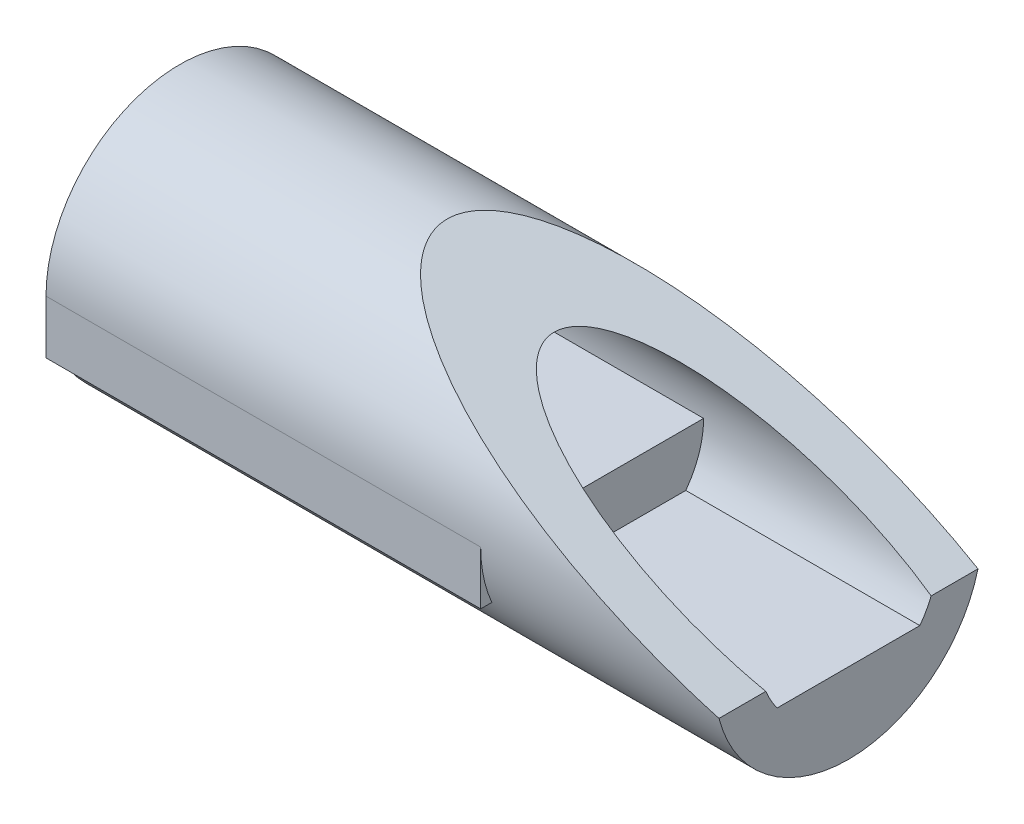
ISO-10303-21;
HEADER;
FILE_DESCRIPTION(('STEP AP214'),'2;1');
FILE_NAME('part.step','',(''),(''),'','','');
FILE_SCHEMA(('AUTOMOTIVE_DESIGN { 1 0 10303 214 1 1 1 1 }'));
ENDSEC;
DATA;
#1=APPLICATION_CONTEXT('core data for automotive mechanical design processes');
#2=APPLICATION_PROTOCOL_DEFINITION('international standard','automotive_design',2000,#1);
#3=PRODUCT_CONTEXT('',#1,'mechanical');
#4=PRODUCT('Part','Part','',(#3));
#5=PRODUCT_RELATED_PRODUCT_CATEGORY('part','',(#4));
#6=PRODUCT_DEFINITION_FORMATION('','',#4);
#7=PRODUCT_DEFINITION_CONTEXT('part definition',#1,'design');
#8=PRODUCT_DEFINITION('design','',#6,#7);
#9=PRODUCT_DEFINITION_SHAPE('','',#8);
#10=(LENGTH_UNIT() NAMED_UNIT(*) SI_UNIT(.MILLI.,.METRE.));
#11=(NAMED_UNIT(*) PLANE_ANGLE_UNIT() SI_UNIT($,.RADIAN.));
#12=(NAMED_UNIT(*) SI_UNIT($,.STERADIAN.) SOLID_ANGLE_UNIT());
#13=UNCERTAINTY_MEASURE_WITH_UNIT(LENGTH_MEASURE(1.E-05),#10,'distance_accuracy_value','');
#14=(GEOMETRIC_REPRESENTATION_CONTEXT(3) GLOBAL_UNCERTAINTY_ASSIGNED_CONTEXT((#13)) GLOBAL_UNIT_ASSIGNED_CONTEXT((#10,
#11,#12)) REPRESENTATION_CONTEXT('',''));
#15=CARTESIAN_POINT('',(0.,0.,0.));
#16=DIRECTION('',(0.,0.,1.));
#17=DIRECTION('',(1.,0.,0.));
#18=AXIS2_PLACEMENT_3D('',#15,#16,#17);
#19=CARTESIAN_POINT('',(-100.,0.,0.));
#20=DIRECTION('',(1.,0.,0.));
#21=DIRECTION('',(0.,0.,-1.));
#22=AXIS2_PLACEMENT_3D('',#19,#20,#21);
#23=CYLINDRICAL_SURFACE('',#22,13.3375847050911);
#24=CARTESIAN_POINT('',(-12.,0.,0.));
#25=DIRECTION('',(0.384615384615385,0.923076923076923,0.));
#26=DIRECTION('',(0.923076923076923,-0.384615384615385,0.));
#27=AXIS2_PLACEMENT_3D('',#24,#25,#26);
#28=ELLIPSE('',#27,34.6777202332369,13.3375847050911);
#29=CARTESIAN_POINT('',(0.,-5.,12.3649167310371));
#30=VERTEX_POINT('',#29);
#31=CARTESIAN_POINT('',(0.,-5.,-12.3649167310371));
#32=VERTEX_POINT('',#31);
#33=EDGE_CURVE('E185',#30,#32,#28,.F.);
#34=ORIENTED_EDGE('',*,*,#33,.F.);
#35=CARTESIAN_POINT('',(0.,0.,0.));
#36=DIRECTION('',(1.,0.,0.));
#37=DIRECTION('',(0.,0.,-1.));
#38=AXIS2_PLACEMENT_3D('',#35,#36,#37);
#39=CIRCLE('',#38,13.3375847050911);
#40=CARTESIAN_POINT('',(0.,-8.,10.6719804050364));
#41=VERTEX_POINT('',#40);
#42=EDGE_CURVE('E194',#30,#41,#39,.T.);
#43=ORIENTED_EDGE('',*,*,#42,.T.);
#44=DIRECTION('',(1.,0.,0.));
#45=VECTOR('',#44,1.);
#46=CARTESIAN_POINT('',(-100.,-8.,10.6719804050364));
#47=LINE('',#46,#45);
#48=CARTESIAN_POINT('',(-35.,-8.,10.6719804050364));
#49=VERTEX_POINT('',#48);
#50=EDGE_CURVE('E207',#49,#41,#47,.T.);
#51=ORIENTED_EDGE('',*,*,#50,.F.);
#52=CARTESIAN_POINT('',(-35.,0.,0.));
#53=DIRECTION('',(-1.,0.,0.));
#54=DIRECTION('',(0.,0.,1.));
#55=AXIS2_PLACEMENT_3D('',#52,#53,#54);
#56=CIRCLE('',#55,13.3375847050911);
#57=CARTESIAN_POINT('',(-35.,0.,13.3375847050911));
#58=VERTEX_POINT('',#57);
#59=EDGE_CURVE('E195',#58,#49,#56,.F.);
#60=ORIENTED_EDGE('',*,*,#59,.F.);
#61=DIRECTION('',(1.,0.,0.));
#62=VECTOR('',#61,1.);
#63=CARTESIAN_POINT('',(-100.,0.,13.3375847050911));
#64=LINE('',#63,#62);
#65=CARTESIAN_POINT('',(-100.,0.,13.3375847050911));
#66=VERTEX_POINT('',#65);
#67=EDGE_CURVE('E258',#58,#66,#64,.F.);
#68=ORIENTED_EDGE('',*,*,#67,.T.);
#69=CARTESIAN_POINT('',(-100.,0.,0.));
#70=DIRECTION('',(1.,0.,0.));
#71=DIRECTION('',(0.,0.,-1.));
#72=AXIS2_PLACEMENT_3D('',#69,#70,#71);
#73=CIRCLE('',#72,13.3375847050911);
#74=CARTESIAN_POINT('',(-100.,0.,-13.3375847050911));
#75=VERTEX_POINT('',#74);
#76=EDGE_CURVE('E206',#75,#66,#73,.T.);
#77=ORIENTED_EDGE('',*,*,#76,.F.);
#78=DIRECTION('',(1.,0.,0.));
#79=VECTOR('',#78,1.);
#80=CARTESIAN_POINT('',(-100.,0.,-13.3375847050911));
#81=LINE('',#80,#79);
#82=CARTESIAN_POINT('',(-35.,0.,-13.3375847050911));
#83=VERTEX_POINT('',#82);
#84=EDGE_CURVE('E255',#75,#83,#81,.T.);
#85=ORIENTED_EDGE('',*,*,#84,.T.);
#86=CARTESIAN_POINT('',(-35.,-8.,-10.6719804050364));
#87=VERTEX_POINT('',#86);
#88=EDGE_CURVE('E199',#87,#83,#56,.F.);
#89=ORIENTED_EDGE('',*,*,#88,.F.);
#90=DIRECTION('',(1.,0.,0.));
#91=VECTOR('',#90,1.);
#92=CARTESIAN_POINT('',(-100.,-8.,-10.6719804050364));
#93=LINE('',#92,#91);
#94=CARTESIAN_POINT('',(0.,-8.,-10.6719804050364));
#95=VERTEX_POINT('',#94);
#96=EDGE_CURVE('E211',#87,#95,#93,.T.);
#97=ORIENTED_EDGE('',*,*,#96,.T.);
#98=EDGE_CURVE('E197',#95,#32,#39,.T.);
#99=ORIENTED_EDGE('',*,*,#98,.T.);
#100=EDGE_LOOP('',(#34,#43,#51,#60,#68,#77,#85,#89,#97,#99));
#101=FACE_BOUND('',#100,.T.);
#102=ADVANCED_FACE('F95',(#101),#23,.F.);
#103=CARTESIAN_POINT('',(-100.,0.,0.));
#104=DIRECTION('',(1.,0.,0.));
#105=DIRECTION('',(0.,0.,-1.));
#106=AXIS2_PLACEMENT_3D('',#103,#104,#105);
#107=CYLINDRICAL_SURFACE('',#106,20.);
#108=DIRECTION('',(-1.,0.,0.));
#109=VECTOR('',#108,1.);
#110=CARTESIAN_POINT('',(0.,0.,20.));
#111=LINE('',#110,#109);
#112=CARTESIAN_POINT('',(-35.,0.,20.));
#113=VERTEX_POINT('',#112);
#114=CARTESIAN_POINT('',(-100.,0.,20.));
#115=VERTEX_POINT('',#114);
#116=EDGE_CURVE('E226',#113,#115,#111,.T.);
#117=ORIENTED_EDGE('',*,*,#116,.F.);
#118=CARTESIAN_POINT('',(-35.,0.,0.));
#119=DIRECTION('',(-1.,0.,0.));
#120=DIRECTION('',(0.,0.,1.));
#121=AXIS2_PLACEMENT_3D('',#118,#119,#120);
#122=CIRCLE('',#121,20.);
#123=CARTESIAN_POINT('',(-35.,-8.,18.3303027798234));
#124=VERTEX_POINT('',#123);
#125=EDGE_CURVE('E214',#113,#124,#122,.F.);
#126=ORIENTED_EDGE('',*,*,#125,.T.);
#127=DIRECTION('',(1.,0.,0.));
#128=VECTOR('',#127,1.);
#129=CARTESIAN_POINT('',(-100.,-8.,18.3303027798234));
#130=LINE('',#129,#128);
#131=CARTESIAN_POINT('',(-100.,-8.,18.3303027798234));
#132=VERTEX_POINT('',#131);
#133=EDGE_CURVE('E222',#124,#132,#130,.F.);
#134=ORIENTED_EDGE('',*,*,#133,.T.);
#135=CARTESIAN_POINT('',(-100.,0.,0.));
#136=DIRECTION('',(1.,0.,0.));
#137=DIRECTION('',(0.,0.,-1.));
#138=AXIS2_PLACEMENT_3D('',#135,#136,#137);
#139=CIRCLE('',#138,20.);
#140=CARTESIAN_POINT('',(-100.,-8.,-18.3303027798234));
#141=VERTEX_POINT('',#140);
#142=EDGE_CURVE('E262',#132,#141,#139,.T.);
#143=ORIENTED_EDGE('',*,*,#142,.T.);
#144=DIRECTION('',(1.,0.,0.));
#145=VECTOR('',#144,1.);
#146=CARTESIAN_POINT('',(-100.,-8.,-18.3303027798234));
#147=LINE('',#146,#145);
#148=CARTESIAN_POINT('',(-35.,-8.,-18.3303027798234));
#149=VERTEX_POINT('',#148);
#150=EDGE_CURVE('E252',#141,#149,#147,.T.);
#151=ORIENTED_EDGE('',*,*,#150,.T.);
#152=CARTESIAN_POINT('',(-35.,0.,-20.));
#153=VERTEX_POINT('',#152);
#154=EDGE_CURVE('E210',#149,#153,#122,.F.);
#155=ORIENTED_EDGE('',*,*,#154,.T.);
#156=DIRECTION('',(-1.,0.,0.));
#157=VECTOR('',#156,1.);
#158=CARTESIAN_POINT('',(0.,0.,-20.));
#159=LINE('',#158,#157);
#160=CARTESIAN_POINT('',(-100.,0.,-20.));
#161=VERTEX_POINT('',#160);
#162=EDGE_CURVE('E275',#153,#161,#159,.T.);
#163=ORIENTED_EDGE('',*,*,#162,.T.);
#164=EDGE_CURVE('E212',#161,#115,#139,.T.);
#165=ORIENTED_EDGE('',*,*,#164,.T.);
#166=EDGE_LOOP('',(#117,#126,#134,#143,#151,#155,#163,#165));
#167=FACE_BOUND('',#166,.T.);
#168=CARTESIAN_POINT('',(0.,0.,0.));
#169=DIRECTION('',(1.,0.,0.));
#170=DIRECTION('',(0.,0.,-1.));
#171=AXIS2_PLACEMENT_3D('',#168,#169,#170);
#172=CIRCLE('',#171,20.);
#173=CARTESIAN_POINT('',(0.,-5.,19.3649167310371));
#174=VERTEX_POINT('',#173);
#175=CARTESIAN_POINT('',(0.,-5.,-19.3649167310371));
#176=VERTEX_POINT('',#175);
#177=EDGE_CURVE('E184',#174,#176,#172,.T.);
#178=ORIENTED_EDGE('',*,*,#177,.F.);
#179=CARTESIAN_POINT('',(-12.,0.,0.));
#180=DIRECTION('',(0.384615384615385,0.923076923076923,0.));
#181=DIRECTION('',(0.923076923076923,-0.384615384615385,0.));
#182=AXIS2_PLACEMENT_3D('',#179,#180,#181);
#183=ELLIPSE('',#182,52.,20.);
#184=EDGE_CURVE('E110',#174,#176,#183,.F.);
#185=ORIENTED_EDGE('',*,*,#184,.T.);
#186=EDGE_LOOP('',(#178,#185));
#187=FACE_BOUND('',#186,.T.);
#188=ADVANCED_FACE('F97',(#167,#187),#107,.T.);
#189=CARTESIAN_POINT('',(0.,0.,0.));
#190=DIRECTION('',(1.,0.,0.));
#191=DIRECTION('',(0.,0.,-1.));
#192=AXIS2_PLACEMENT_3D('',#189,#190,#191);
#193=PLANE('',#192);
#194=ORIENTED_EDGE('',*,*,#177,.T.);
#195=DIRECTION('',(0.,0.,1.));
#196=VECTOR('',#195,1.);
#197=CARTESIAN_POINT('',(0.,-5.,0.));
#198=LINE('',#197,#196);
#199=EDGE_CURVE('E12',#176,#32,#198,.T.);
#200=ORIENTED_EDGE('',*,*,#199,.T.);
#201=ORIENTED_EDGE('',*,*,#98,.F.);
#202=DIRECTION('',(0.,0.,-1.));
#203=VECTOR('',#202,1.);
#204=CARTESIAN_POINT('',(0.,-8.,0.));
#205=LINE('',#204,#203);
#206=EDGE_CURVE('E203',#41,#95,#205,.T.);
#207=ORIENTED_EDGE('',*,*,#206,.F.);
#208=ORIENTED_EDGE('',*,*,#42,.F.);
#209=EDGE_CURVE('E99',#30,#174,#198,.T.);
#210=ORIENTED_EDGE('',*,*,#209,.T.);
#211=EDGE_LOOP('',(#194,#200,#201,#207,#208,#210));
#212=FACE_BOUND('',#211,.T.);
#213=ADVANCED_FACE('F192',(#212),#193,.T.);
#214=CARTESIAN_POINT('',(-100.,-8.,0.));
#215=DIRECTION('',(0.,-1.,0.));
#216=DIRECTION('',(0.,0.,-1.));
#217=AXIS2_PLACEMENT_3D('',#214,#215,#216);
#218=PLANE('',#217);
#219=DIRECTION('',(0.,0.,-1.));
#220=VECTOR('',#219,1.);
#221=CARTESIAN_POINT('',(-35.,-8.,0.));
#222=LINE('',#221,#220);
#223=EDGE_CURVE('E276',#49,#87,#222,.T.);
#224=ORIENTED_EDGE('',*,*,#223,.F.);
#225=ORIENTED_EDGE('',*,*,#50,.T.);
#226=ORIENTED_EDGE('',*,*,#206,.T.);
#227=ORIENTED_EDGE('',*,*,#96,.F.);
#228=EDGE_LOOP('',(#224,#225,#226,#227));
#229=FACE_BOUND('',#228,.T.);
#230=ADVANCED_FACE('F301',(#229),#218,.F.);
#231=CARTESIAN_POINT('',(-100.,0.,0.));
#232=DIRECTION('',(1.,0.,0.));
#233=DIRECTION('',(0.,0.,-1.));
#234=AXIS2_PLACEMENT_3D('',#231,#232,#233);
#235=PLANE('',#234);
#236=DIRECTION('',(0.,0.,1.));
#237=VECTOR('',#236,1.);
#238=CARTESIAN_POINT('',(-100.,0.,0.));
#239=LINE('',#238,#237);
#240=EDGE_CURVE('E277',#75,#66,#239,.T.);
#241=ORIENTED_EDGE('',*,*,#240,.F.);
#242=ORIENTED_EDGE('',*,*,#76,.T.);
#243=EDGE_LOOP('',(#241,#242));
#244=FACE_BOUND('',#243,.T.);
#245=ORIENTED_EDGE('',*,*,#164,.F.);
#246=DIRECTION('',(0.,-1.,0.));
#247=VECTOR('',#246,1.);
#248=CARTESIAN_POINT('',(-100.,0.,-20.));
#249=LINE('',#248,#247);
#250=CARTESIAN_POINT('',(-100.,-8.,-20.));
#251=VERTEX_POINT('',#250);
#252=EDGE_CURVE('E243',#161,#251,#249,.T.);
#253=ORIENTED_EDGE('',*,*,#252,.T.);
#254=DIRECTION('',(0.,0.,1.));
#255=VECTOR('',#254,1.);
#256=CARTESIAN_POINT('',(-100.,-8.,0.));
#257=LINE('',#256,#255);
#258=EDGE_CURVE('E268',#251,#141,#257,.T.);
#259=ORIENTED_EDGE('',*,*,#258,.T.);
#260=ORIENTED_EDGE('',*,*,#142,.F.);
#261=CARTESIAN_POINT('',(-100.,-8.,20.));
#262=VERTEX_POINT('',#261);
#263=EDGE_CURVE('E267',#132,#262,#257,.T.);
#264=ORIENTED_EDGE('',*,*,#263,.T.);
#265=DIRECTION('',(0.,-1.,0.));
#266=VECTOR('',#265,1.);
#267=CARTESIAN_POINT('',(-100.,0.,20.));
#268=LINE('',#267,#266);
#269=EDGE_CURVE('E240',#115,#262,#268,.T.);
#270=ORIENTED_EDGE('',*,*,#269,.F.);
#271=EDGE_LOOP('',(#245,#253,#259,#260,#264,#270));
#272=FACE_BOUND('',#271,.T.);
#273=ADVANCED_FACE('F266',(#244,#272),#235,.F.);
#274=CARTESIAN_POINT('',(0.,0.,0.));
#275=DIRECTION('',(0.,1.,0.));
#276=DIRECTION('',(0.,0.,1.));
#277=AXIS2_PLACEMENT_3D('',#274,#275,#276);
#278=PLANE('',#277);
#279=ORIENTED_EDGE('',*,*,#67,.F.);
#280=DIRECTION('',(0.,0.,-1.));
#281=VECTOR('',#280,1.);
#282=CARTESIAN_POINT('',(-35.,0.,0.));
#283=LINE('',#282,#281);
#284=EDGE_CURVE('E246',#58,#83,#283,.T.);
#285=ORIENTED_EDGE('',*,*,#284,.T.);
#286=ORIENTED_EDGE('',*,*,#84,.F.);
#287=ORIENTED_EDGE('',*,*,#240,.T.);
#288=EDGE_LOOP('',(#279,#285,#286,#287));
#289=FACE_BOUND('',#288,.T.);
#290=ADVANCED_FACE('F291',(#289),#278,.T.);
#291=CARTESIAN_POINT('',(-35.,0.,0.));
#292=DIRECTION('',(-1.,0.,0.));
#293=DIRECTION('',(0.,0.,1.));
#294=AXIS2_PLACEMENT_3D('',#291,#292,#293);
#295=PLANE('',#294);
#296=ORIENTED_EDGE('',*,*,#284,.F.);
#297=ORIENTED_EDGE('',*,*,#59,.T.);
#298=ORIENTED_EDGE('',*,*,#223,.T.);
#299=ORIENTED_EDGE('',*,*,#88,.T.);
#300=EDGE_LOOP('',(#296,#297,#298,#299));
#301=FACE_BOUND('',#300,.T.);
#302=ADVANCED_FACE('F307',(#301),#295,.F.);
#303=CARTESIAN_POINT('',(0.,-8.,0.));
#304=DIRECTION('',(0.,1.,0.));
#305=DIRECTION('',(0.,0.,1.));
#306=AXIS2_PLACEMENT_3D('',#303,#304,#305);
#307=PLANE('',#306);
#308=ORIENTED_EDGE('',*,*,#150,.F.);
#309=ORIENTED_EDGE('',*,*,#258,.F.);
#310=DIRECTION('',(-1.,0.,0.));
#311=VECTOR('',#310,1.);
#312=CARTESIAN_POINT('',(0.,-8.,-20.));
#313=LINE('',#312,#311);
#314=CARTESIAN_POINT('',(-35.,-8.,-20.));
#315=VERTEX_POINT('',#314);
#316=EDGE_CURVE('E272',#315,#251,#313,.T.);
#317=ORIENTED_EDGE('',*,*,#316,.F.);
#318=EDGE_CURVE('E118',#149,#315,#222,.T.);
#319=ORIENTED_EDGE('',*,*,#318,.F.);
#320=EDGE_LOOP('',(#308,#309,#317,#319));
#321=FACE_BOUND('',#320,.T.);
#322=ADVANCED_FACE('F284',(#321),#307,.F.);
#323=CARTESIAN_POINT('',(0.,0.,-20.));
#324=DIRECTION('',(0.,0.,1.));
#325=DIRECTION('',(1.,0.,0.));
#326=AXIS2_PLACEMENT_3D('',#323,#324,#325);
#327=PLANE('',#326);
#328=ORIENTED_EDGE('',*,*,#316,.T.);
#329=ORIENTED_EDGE('',*,*,#252,.F.);
#330=ORIENTED_EDGE('',*,*,#162,.F.);
#331=DIRECTION('',(0.,-1.,0.));
#332=VECTOR('',#331,1.);
#333=CARTESIAN_POINT('',(-35.,0.,-20.));
#334=LINE('',#333,#332);
#335=EDGE_CURVE('E241',#153,#315,#334,.T.);
#336=ORIENTED_EDGE('',*,*,#335,.T.);
#337=EDGE_LOOP('',(#328,#329,#330,#336));
#338=FACE_BOUND('',#337,.T.);
#339=ADVANCED_FACE('F283',(#338),#327,.F.);
#340=ORIENTED_EDGE('',*,*,#154,.F.);
#341=ORIENTED_EDGE('',*,*,#318,.T.);
#342=ORIENTED_EDGE('',*,*,#335,.F.);
#343=EDGE_LOOP('',(#340,#341,#342));
#344=FACE_BOUND('',#343,.T.);
#345=ADVANCED_FACE('F280',(#344),#295,.F.);
#346=ORIENTED_EDGE('',*,*,#125,.F.);
#347=DIRECTION('',(0.,-1.,0.));
#348=VECTOR('',#347,1.);
#349=CARTESIAN_POINT('',(-35.,0.,20.));
#350=LINE('',#349,#348);
#351=CARTESIAN_POINT('',(-35.,-8.,20.));
#352=VERTEX_POINT('',#351);
#353=EDGE_CURVE('E231',#113,#352,#350,.T.);
#354=ORIENTED_EDGE('',*,*,#353,.T.);
#355=EDGE_CURVE('E233',#352,#124,#222,.T.);
#356=ORIENTED_EDGE('',*,*,#355,.T.);
#357=EDGE_LOOP('',(#346,#354,#356));
#358=FACE_BOUND('',#357,.T.);
#359=ADVANCED_FACE('F230',(#358),#295,.F.);
#360=ORIENTED_EDGE('',*,*,#133,.F.);
#361=ORIENTED_EDGE('',*,*,#355,.F.);
#362=DIRECTION('',(-1.,0.,0.));
#363=VECTOR('',#362,1.);
#364=CARTESIAN_POINT('',(0.,-8.,20.));
#365=LINE('',#364,#363);
#366=EDGE_CURVE('E239',#352,#262,#365,.T.);
#367=ORIENTED_EDGE('',*,*,#366,.T.);
#368=ORIENTED_EDGE('',*,*,#263,.F.);
#369=EDGE_LOOP('',(#360,#361,#367,#368));
#370=FACE_BOUND('',#369,.T.);
#371=ADVANCED_FACE('F363',(#370),#307,.F.);
#372=CARTESIAN_POINT('',(0.,0.,20.));
#373=DIRECTION('',(0.,0.,1.));
#374=DIRECTION('',(1.,0.,0.));
#375=AXIS2_PLACEMENT_3D('',#372,#373,#374);
#376=PLANE('',#375);
#377=ORIENTED_EDGE('',*,*,#366,.F.);
#378=ORIENTED_EDGE('',*,*,#353,.F.);
#379=ORIENTED_EDGE('',*,*,#116,.T.);
#380=ORIENTED_EDGE('',*,*,#269,.T.);
#381=EDGE_LOOP('',(#377,#378,#379,#380));
#382=FACE_BOUND('',#381,.T.);
#383=ADVANCED_FACE('F236',(#382),#376,.T.);
#384=CARTESIAN_POINT('',(-1.77514792899408,-4.2603550295858,-20.));
#385=DIRECTION('',(0.384615384615385,0.923076923076923,0.));
#386=DIRECTION('',(-0.923076923076923,0.384615384615385,0.));
#387=AXIS2_PLACEMENT_3D('',#384,#385,#386);
#388=PLANE('',#387);
#389=ORIENTED_EDGE('',*,*,#33,.T.);
#390=ORIENTED_EDGE('',*,*,#199,.F.);
#391=ORIENTED_EDGE('',*,*,#184,.F.);
#392=ORIENTED_EDGE('',*,*,#209,.F.);
#393=EDGE_LOOP('',(#389,#390,#391,#392));
#394=FACE_BOUND('',#393,.T.);
#395=ADVANCED_FACE('F187',(#394),#388,.T.);
#396=CLOSED_SHELL('',(#102,#188,#213,#230,#273,#290,#302,#322,#339,#345,#359,#371,#383,#395));
#397=MANIFOLD_SOLID_BREP('B2',#396);
#398=ADVANCED_BREP_SHAPE_REPRESENTATION('',(#18,#397),#14);
#399=SHAPE_DEFINITION_REPRESENTATION(#9,#398);
ENDSEC;
END-ISO-10303-21;
